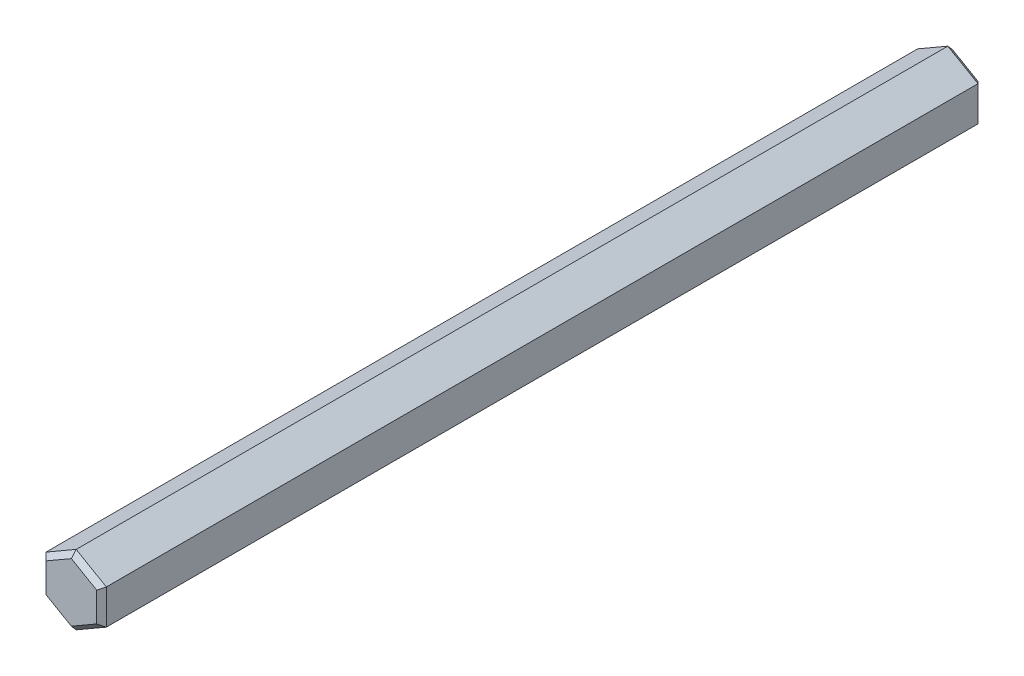
ISO-10303-21;
HEADER;
FILE_DESCRIPTION(('STEP AP214'),'2;1');
FILE_NAME('part.step','',(''),(''),'','','');
FILE_SCHEMA(('AUTOMOTIVE_DESIGN { 1 0 10303 214 1 1 1 1 }'));
ENDSEC;
DATA;
#1=APPLICATION_CONTEXT('core data for automotive mechanical design processes');
#2=APPLICATION_PROTOCOL_DEFINITION('international standard','automotive_design',2000,#1);
#3=PRODUCT_CONTEXT('',#1,'mechanical');
#4=PRODUCT('Part','Part','',(#3));
#5=PRODUCT_RELATED_PRODUCT_CATEGORY('part','',(#4));
#6=PRODUCT_DEFINITION_FORMATION('','',#4);
#7=PRODUCT_DEFINITION_CONTEXT('part definition',#1,'design');
#8=PRODUCT_DEFINITION('design','',#6,#7);
#9=PRODUCT_DEFINITION_SHAPE('','',#8);
#10=(LENGTH_UNIT() NAMED_UNIT(*) SI_UNIT(.MILLI.,.METRE.));
#11=(NAMED_UNIT(*) PLANE_ANGLE_UNIT() SI_UNIT($,.RADIAN.));
#12=(NAMED_UNIT(*) SI_UNIT($,.STERADIAN.) SOLID_ANGLE_UNIT());
#13=UNCERTAINTY_MEASURE_WITH_UNIT(LENGTH_MEASURE(1.E-05),#10,'distance_accuracy_value','');
#14=(GEOMETRIC_REPRESENTATION_CONTEXT(3) GLOBAL_UNCERTAINTY_ASSIGNED_CONTEXT((#13)) GLOBAL_UNIT_ASSIGNED_CONTEXT((#10,
#11,#12)) REPRESENTATION_CONTEXT('',''));
#15=CARTESIAN_POINT('',(0.,0.,0.));
#16=DIRECTION('',(0.,0.,1.));
#17=DIRECTION('',(1.,0.,0.));
#18=AXIS2_PLACEMENT_3D('',#15,#16,#17);
#19=CARTESIAN_POINT('',(-2.5,-1.44337567297406,1.975));
#20=DIRECTION('',(-0.5,-0.866025403784439,0.));
#21=DIRECTION('',(0.866025403784439,-0.5,0.));
#22=AXIS2_PLACEMENT_3D('',#19,#20,#21);
#23=PLANE('',#22);
#24=DIRECTION('',(0.,0.,1.));
#25=VECTOR('',#24,1.);
#26=CARTESIAN_POINT('',(-2.5,-1.44337567297406,1.975));
#27=LINE('',#26,#25);
#28=CARTESIAN_POINT('',(-2.5,-1.44337567297406,2.37500000000001));
#29=VERTEX_POINT('',#28);
#30=CARTESIAN_POINT('',(-2.5,-1.44337567297406,74.6));
#31=VERTEX_POINT('',#30);
#32=EDGE_CURVE('E150',#29,#31,#27,.T.);
#33=ORIENTED_EDGE('',*,*,#32,.F.);
#34=DIRECTION('',(0.866025403784439,-0.5,0.));
#35=VECTOR('',#34,1.);
#36=CARTESIAN_POINT('',(0.,-2.88675134594813,2.37500000000001));
#37=LINE('',#36,#35);
#38=CARTESIAN_POINT('',(0.,-2.88675134594813,2.37500000000001));
#39=VERTEX_POINT('',#38);
#40=EDGE_CURVE('E182',#29,#39,#37,.T.);
#41=ORIENTED_EDGE('',*,*,#40,.T.);
#42=DIRECTION('',(0.,0.,1.));
#43=VECTOR('',#42,1.);
#44=CARTESIAN_POINT('',(0.,-2.88675134594813,1.975));
#45=LINE('',#44,#43);
#46=CARTESIAN_POINT('',(0.,-2.88675134594813,74.6));
#47=VERTEX_POINT('',#46);
#48=EDGE_CURVE('E215',#39,#47,#45,.T.);
#49=ORIENTED_EDGE('',*,*,#48,.T.);
#50=DIRECTION('',(-0.866025403784439,0.5,0.));
#51=VECTOR('',#50,1.);
#52=CARTESIAN_POINT('',(-2.5,-1.44337567297406,74.6));
#53=LINE('',#52,#51);
#54=EDGE_CURVE('E180',#47,#31,#53,.T.);
#55=ORIENTED_EDGE('',*,*,#54,.T.);
#56=EDGE_LOOP('',(#33,#41,#49,#55));
#57=FACE_BOUND('',#56,.T.);
#58=ADVANCED_FACE('F33',(#57),#23,.T.);
#59=CARTESIAN_POINT('',(-2.5,1.44337567297407,1.975));
#60=DIRECTION('',(-1.,0.,0.));
#61=DIRECTION('',(0.,0.,1.));
#62=AXIS2_PLACEMENT_3D('',#59,#60,#61);
#63=PLANE('',#62);
#64=DIRECTION('',(0.,0.,1.));
#65=VECTOR('',#64,1.);
#66=CARTESIAN_POINT('',(-2.5,1.44337567297407,1.975));
#67=LINE('',#66,#65);
#68=CARTESIAN_POINT('',(-2.5,1.44337567297407,2.37500000000001));
#69=VERTEX_POINT('',#68);
#70=CARTESIAN_POINT('',(-2.5,1.44337567297407,74.6));
#71=VERTEX_POINT('',#70);
#72=EDGE_CURVE('E131',#69,#71,#67,.T.);
#73=ORIENTED_EDGE('',*,*,#72,.F.);
#74=DIRECTION('',(0.,-1.,0.));
#75=VECTOR('',#74,1.);
#76=CARTESIAN_POINT('',(-2.5,-1.44337567297406,2.37500000000001));
#77=LINE('',#76,#75);
#78=EDGE_CURVE('E146',#69,#29,#77,.T.);
#79=ORIENTED_EDGE('',*,*,#78,.T.);
#80=ORIENTED_EDGE('',*,*,#32,.T.);
#81=DIRECTION('',(0.,1.,0.));
#82=VECTOR('',#81,1.);
#83=CARTESIAN_POINT('',(-2.5,1.44337567297407,74.6));
#84=LINE('',#83,#82);
#85=EDGE_CURVE('E149',#31,#71,#84,.T.);
#86=ORIENTED_EDGE('',*,*,#85,.T.);
#87=EDGE_LOOP('',(#73,#79,#80,#86));
#88=FACE_BOUND('',#87,.T.);
#89=ADVANCED_FACE('F143',(#88),#63,.T.);
#90=CARTESIAN_POINT('',(0.,2.88675134594813,1.975));
#91=DIRECTION('',(-0.5,0.866025403784439,0.));
#92=DIRECTION('',(-0.866025403784439,-0.5,0.));
#93=AXIS2_PLACEMENT_3D('',#90,#91,#92);
#94=PLANE('',#93);
#95=DIRECTION('',(0.,0.,1.));
#96=VECTOR('',#95,1.);
#97=CARTESIAN_POINT('',(0.,2.88675134594813,1.975));
#98=LINE('',#97,#96);
#99=CARTESIAN_POINT('',(0.,2.88675134594813,2.37500000000001));
#100=VERTEX_POINT('',#99);
#101=CARTESIAN_POINT('',(0.,2.88675134594813,74.6));
#102=VERTEX_POINT('',#101);
#103=EDGE_CURVE('E133',#100,#102,#98,.T.);
#104=ORIENTED_EDGE('',*,*,#103,.F.);
#105=DIRECTION('',(-0.866025403784439,-0.5,0.));
#106=VECTOR('',#105,1.);
#107=CARTESIAN_POINT('',(-2.5,1.44337567297407,2.37500000000001));
#108=LINE('',#107,#106);
#109=EDGE_CURVE('E127',#100,#69,#108,.T.);
#110=ORIENTED_EDGE('',*,*,#109,.T.);
#111=ORIENTED_EDGE('',*,*,#72,.T.);
#112=DIRECTION('',(0.866025403784439,0.5,0.));
#113=VECTOR('',#112,1.);
#114=CARTESIAN_POINT('',(0.,2.88675134594813,74.6));
#115=LINE('',#114,#113);
#116=EDGE_CURVE('E139',#71,#102,#115,.T.);
#117=ORIENTED_EDGE('',*,*,#116,.T.);
#118=EDGE_LOOP('',(#104,#110,#111,#117));
#119=FACE_BOUND('',#118,.T.);
#120=ADVANCED_FACE('F129',(#119),#94,.T.);
#121=CARTESIAN_POINT('',(2.5,1.44337567297406,1.975));
#122=DIRECTION('',(0.5,0.866025403784439,0.));
#123=DIRECTION('',(-0.866025403784439,0.5,0.));
#124=AXIS2_PLACEMENT_3D('',#121,#122,#123);
#125=PLANE('',#124);
#126=DIRECTION('',(0.,0.,1.));
#127=VECTOR('',#126,1.);
#128=CARTESIAN_POINT('',(2.5,1.44337567297406,1.975));
#129=LINE('',#128,#127);
#130=CARTESIAN_POINT('',(2.5,1.44337567297406,2.37500000000001));
#131=VERTEX_POINT('',#130);
#132=CARTESIAN_POINT('',(2.5,1.44337567297406,74.6));
#133=VERTEX_POINT('',#132);
#134=EDGE_CURVE('E249',#131,#133,#129,.T.);
#135=ORIENTED_EDGE('',*,*,#134,.F.);
#136=DIRECTION('',(-0.866025403784439,0.5,0.));
#137=VECTOR('',#136,1.);
#138=CARTESIAN_POINT('',(0.,2.88675134594813,2.37500000000001));
#139=LINE('',#138,#137);
#140=EDGE_CURVE('E190',#131,#100,#139,.T.);
#141=ORIENTED_EDGE('',*,*,#140,.T.);
#142=ORIENTED_EDGE('',*,*,#103,.T.);
#143=DIRECTION('',(0.866025403784439,-0.5,0.));
#144=VECTOR('',#143,1.);
#145=CARTESIAN_POINT('',(2.5,1.44337567297406,74.6));
#146=LINE('',#145,#144);
#147=EDGE_CURVE('E188',#102,#133,#146,.T.);
#148=ORIENTED_EDGE('',*,*,#147,.T.);
#149=EDGE_LOOP('',(#135,#141,#142,#148));
#150=FACE_BOUND('',#149,.T.);
#151=ADVANCED_FACE('F266',(#150),#125,.T.);
#152=CARTESIAN_POINT('',(2.5,-1.44337567297406,1.975));
#153=DIRECTION('',(1.,0.,0.));
#154=DIRECTION('',(0.,0.,-1.));
#155=AXIS2_PLACEMENT_3D('',#152,#153,#154);
#156=PLANE('',#155);
#157=DIRECTION('',(0.,0.,1.));
#158=VECTOR('',#157,1.);
#159=CARTESIAN_POINT('',(2.5,-1.44337567297406,1.975));
#160=LINE('',#159,#158);
#161=CARTESIAN_POINT('',(2.5,-1.44337567297406,2.37500000000001));
#162=VERTEX_POINT('',#161);
#163=CARTESIAN_POINT('',(2.5,-1.44337567297406,74.6));
#164=VERTEX_POINT('',#163);
#165=EDGE_CURVE('E247',#162,#164,#160,.T.);
#166=ORIENTED_EDGE('',*,*,#165,.F.);
#167=DIRECTION('',(0.,1.,0.));
#168=VECTOR('',#167,1.);
#169=CARTESIAN_POINT('',(2.5,1.44337567297406,2.37500000000001));
#170=LINE('',#169,#168);
#171=EDGE_CURVE('E194',#162,#131,#170,.T.);
#172=ORIENTED_EDGE('',*,*,#171,.T.);
#173=ORIENTED_EDGE('',*,*,#134,.T.);
#174=DIRECTION('',(0.,-1.,0.));
#175=VECTOR('',#174,1.);
#176=CARTESIAN_POINT('',(2.5,-1.44337567297406,74.6));
#177=LINE('',#176,#175);
#178=EDGE_CURVE('E192',#133,#164,#177,.T.);
#179=ORIENTED_EDGE('',*,*,#178,.T.);
#180=EDGE_LOOP('',(#166,#172,#173,#179));
#181=FACE_BOUND('',#180,.T.);
#182=ADVANCED_FACE('F303',(#181),#156,.T.);
#183=CARTESIAN_POINT('',(0.,-2.88675134594813,1.975));
#184=DIRECTION('',(0.5,-0.866025403784439,0.));
#185=DIRECTION('',(0.866025403784439,0.5,0.));
#186=AXIS2_PLACEMENT_3D('',#183,#184,#185);
#187=PLANE('',#186);
#188=ORIENTED_EDGE('',*,*,#48,.F.);
#189=DIRECTION('',(0.866025403784439,0.5,0.));
#190=VECTOR('',#189,1.);
#191=CARTESIAN_POINT('',(2.5,-1.44337567297406,2.37500000000001));
#192=LINE('',#191,#190);
#193=EDGE_CURVE('E186',#39,#162,#192,.T.);
#194=ORIENTED_EDGE('',*,*,#193,.T.);
#195=ORIENTED_EDGE('',*,*,#165,.T.);
#196=DIRECTION('',(-0.866025403784439,-0.5,0.));
#197=VECTOR('',#196,1.);
#198=CARTESIAN_POINT('',(0.,-2.88675134594813,74.6));
#199=LINE('',#198,#197);
#200=EDGE_CURVE('E138',#164,#47,#199,.T.);
#201=ORIENTED_EDGE('',*,*,#200,.T.);
#202=EDGE_LOOP('',(#188,#194,#195,#201));
#203=FACE_BOUND('',#202,.T.);
#204=ADVANCED_FACE('F244',(#203),#187,.T.);
#205=CARTESIAN_POINT('',(0.,0.,1.975));
#206=DIRECTION('',(0.,0.,1.));
#207=DIRECTION('',(1.,0.,0.));
#208=AXIS2_PLACEMENT_3D('',#205,#206,#207);
#209=PLANE('',#208);
#210=DIRECTION('',(-0.866025403784439,0.5,0.));
#211=VECTOR('',#210,1.);
#212=CARTESIAN_POINT('',(-2.3,-1.09696551146029,1.975));
#213=LINE('',#212,#211);
#214=CARTESIAN_POINT('',(0.,-2.42487113059643,1.975));
#215=VERTEX_POINT('',#214);
#216=CARTESIAN_POINT('',(-2.1,-1.21243556529822,1.975));
#217=VERTEX_POINT('',#216);
#218=EDGE_CURVE('E176',#215,#217,#213,.T.);
#219=ORIENTED_EDGE('',*,*,#218,.T.);
#220=DIRECTION('',(0.,1.,0.));
#221=VECTOR('',#220,1.);
#222=CARTESIAN_POINT('',(-2.1,1.44337567297407,1.975));
#223=LINE('',#222,#221);
#224=CARTESIAN_POINT('',(-2.1,1.21243556529822,1.975));
#225=VERTEX_POINT('',#224);
#226=EDGE_CURVE('E178',#217,#225,#223,.T.);
#227=ORIENTED_EDGE('',*,*,#226,.T.);
#228=DIRECTION('',(0.866025403784439,0.5,0.));
#229=VECTOR('',#228,1.);
#230=CARTESIAN_POINT('',(0.199999999999997,2.54034118443435,1.975));
#231=LINE('',#230,#229);
#232=CARTESIAN_POINT('',(0.,2.42487113059643,1.975));
#233=VERTEX_POINT('',#232);
#234=EDGE_CURVE('E155',#225,#233,#231,.T.);
#235=ORIENTED_EDGE('',*,*,#234,.T.);
#236=DIRECTION('',(0.866025403784439,-0.5,0.));
#237=VECTOR('',#236,1.);
#238=CARTESIAN_POINT('',(2.3,1.09696551146029,1.975));
#239=LINE('',#238,#237);
#240=CARTESIAN_POINT('',(2.1,1.21243556529821,1.975));
#241=VERTEX_POINT('',#240);
#242=EDGE_CURVE('E167',#233,#241,#239,.T.);
#243=ORIENTED_EDGE('',*,*,#242,.T.);
#244=DIRECTION('',(0.,-1.,0.));
#245=VECTOR('',#244,1.);
#246=CARTESIAN_POINT('',(2.1,-1.44337567297406,1.975));
#247=LINE('',#246,#245);
#248=CARTESIAN_POINT('',(2.1,-1.21243556529821,1.975));
#249=VERTEX_POINT('',#248);
#250=EDGE_CURVE('E165',#241,#249,#247,.T.);
#251=ORIENTED_EDGE('',*,*,#250,.T.);
#252=DIRECTION('',(-0.866025403784439,-0.5,0.));
#253=VECTOR('',#252,1.);
#254=CARTESIAN_POINT('',(-0.199999999999999,-2.54034118443435,1.975));
#255=LINE('',#254,#253);
#256=EDGE_CURVE('E173',#249,#215,#255,.T.);
#257=ORIENTED_EDGE('',*,*,#256,.T.);
#258=EDGE_LOOP('',(#219,#227,#235,#243,#251,#257));
#259=FACE_BOUND('',#258,.T.);
#260=ADVANCED_FACE('F274',(#259),#209,.F.);
#261=CARTESIAN_POINT('',(0.,0.,75.));
#262=DIRECTION('',(0.,0.,1.));
#263=DIRECTION('',(1.,0.,0.));
#264=AXIS2_PLACEMENT_3D('',#261,#262,#263);
#265=PLANE('',#264);
#266=DIRECTION('',(-0.866025403784439,0.5,0.));
#267=VECTOR('',#266,1.);
#268=CARTESIAN_POINT('',(1.05,1.81865334794732,75.));
#269=LINE('',#268,#267);
#270=CARTESIAN_POINT('',(2.09999999999999,1.21243556529821,75.));
#271=VERTEX_POINT('',#270);
#272=CARTESIAN_POINT('',(0.,2.42487113059642,75.));
#273=VERTEX_POINT('',#272);
#274=EDGE_CURVE('E57',#271,#273,#269,.T.);
#275=ORIENTED_EDGE('',*,*,#274,.T.);
#276=DIRECTION('',(-0.866025403784439,-0.5,0.));
#277=VECTOR('',#276,1.);
#278=CARTESIAN_POINT('',(-1.05,1.81865334794732,75.));
#279=LINE('',#278,#277);
#280=CARTESIAN_POINT('',(-2.1,1.21243556529821,75.));
#281=VERTEX_POINT('',#280);
#282=EDGE_CURVE('E11',#273,#281,#279,.T.);
#283=ORIENTED_EDGE('',*,*,#282,.T.);
#284=DIRECTION('',(0.,-1.,0.));
#285=VECTOR('',#284,1.);
#286=CARTESIAN_POINT('',(-2.1,0.,75.));
#287=LINE('',#286,#285);
#288=CARTESIAN_POINT('',(-2.1,-1.21243556529821,75.));
#289=VERTEX_POINT('',#288);
#290=EDGE_CURVE('E42',#281,#289,#287,.T.);
#291=ORIENTED_EDGE('',*,*,#290,.T.);
#292=DIRECTION('',(0.866025403784439,-0.5,0.));
#293=VECTOR('',#292,1.);
#294=CARTESIAN_POINT('',(-1.05,-1.81865334794732,75.));
#295=LINE('',#294,#293);
#296=CARTESIAN_POINT('',(0.,-2.42487113059642,75.));
#297=VERTEX_POINT('',#296);
#298=EDGE_CURVE('E200',#289,#297,#295,.T.);
#299=ORIENTED_EDGE('',*,*,#298,.T.);
#300=DIRECTION('',(0.866025403784439,0.5,0.));
#301=VECTOR('',#300,1.);
#302=CARTESIAN_POINT('',(1.05,-1.81865334794732,75.));
#303=LINE('',#302,#301);
#304=CARTESIAN_POINT('',(2.09999999999999,-1.21243556529821,75.));
#305=VERTEX_POINT('',#304);
#306=EDGE_CURVE('E196',#297,#305,#303,.T.);
#307=ORIENTED_EDGE('',*,*,#306,.T.);
#308=DIRECTION('',(0.,1.,0.));
#309=VECTOR('',#308,1.);
#310=CARTESIAN_POINT('',(2.09999999999999,0.,75.));
#311=LINE('',#310,#309);
#312=EDGE_CURVE('E198',#305,#271,#311,.T.);
#313=ORIENTED_EDGE('',*,*,#312,.T.);
#314=EDGE_LOOP('',(#275,#283,#291,#299,#307,#313));
#315=FACE_BOUND('',#314,.T.);
#316=ADVANCED_FACE('F259',(#315),#265,.T.);
#317=CARTESIAN_POINT('',(2.5,-1.44337567297406,2.37500000000001));
#318=DIRECTION('',(0.707106781186554,0.,-0.707106781186541));
#319=DIRECTION('',(0.,-1.,0.));
#320=AXIS2_PLACEMENT_3D('',#317,#318,#319);
#321=PLANE('',#320);
#322=DIRECTION('',(-0.654653670707972,0.377964473009224,-0.654653670707984));
#323=VECTOR('',#322,1.);
#324=CARTESIAN_POINT('',(2.5,-1.44337567297406,2.37500000000001));
#325=LINE('',#324,#323);
#326=EDGE_CURVE('E209',#249,#162,#325,.F.);
#327=ORIENTED_EDGE('',*,*,#326,.F.);
#328=ORIENTED_EDGE('',*,*,#250,.F.);
#329=DIRECTION('',(0.654653670707972,0.377964473009225,0.654653670707984));
#330=VECTOR('',#329,1.);
#331=CARTESIAN_POINT('',(1.7857142857143,1.03098262355291,1.66071428571429));
#332=LINE('',#331,#330);
#333=EDGE_CURVE('E212',#131,#241,#332,.F.);
#334=ORIENTED_EDGE('',*,*,#333,.F.);
#335=ORIENTED_EDGE('',*,*,#171,.F.);
#336=EDGE_LOOP('',(#327,#328,#334,#335));
#337=FACE_BOUND('',#336,.T.);
#338=ADVANCED_FACE('F277',(#337),#321,.T.);
#339=CARTESIAN_POINT('',(2.5,1.44337567297406,2.37500000000001));
#340=DIRECTION('',(0.353553390593277,0.6123724356958,-0.707106781186541));
#341=DIRECTION('',(0.866025403784439,-0.5,0.));
#342=AXIS2_PLACEMENT_3D('',#339,#340,#341);
#343=PLANE('',#342);
#344=ORIENTED_EDGE('',*,*,#333,.T.);
#345=ORIENTED_EDGE('',*,*,#242,.F.);
#346=DIRECTION('',(0.,0.755928946018449,0.654653670707984));
#347=VECTOR('',#346,1.);
#348=CARTESIAN_POINT('',(0.,2.06196524710582,1.66071428571429));
#349=LINE('',#348,#347);
#350=EDGE_CURVE('E207',#100,#233,#349,.F.);
#351=ORIENTED_EDGE('',*,*,#350,.F.);
#352=ORIENTED_EDGE('',*,*,#140,.F.);
#353=EDGE_LOOP('',(#344,#345,#351,#352));
#354=FACE_BOUND('',#353,.T.);
#355=ADVANCED_FACE('F270',(#354),#343,.T.);
#356=CARTESIAN_POINT('',(0.,-2.88675134594813,2.37500000000001));
#357=DIRECTION('',(0.353553390593277,-0.6123724356958,-0.707106781186541));
#358=DIRECTION('',(-0.866025403784439,-0.5,0.));
#359=AXIS2_PLACEMENT_3D('',#356,#357,#358);
#360=PLANE('',#359);
#361=ORIENTED_EDGE('',*,*,#326,.T.);
#362=ORIENTED_EDGE('',*,*,#193,.F.);
#363=DIRECTION('',(0.,0.755928946018449,-0.654653670707984));
#364=VECTOR('',#363,1.);
#365=CARTESIAN_POINT('',(0.,-2.88675134594813,2.37500000000001));
#366=LINE('',#365,#364);
#367=EDGE_CURVE('E159',#215,#39,#366,.F.);
#368=ORIENTED_EDGE('',*,*,#367,.F.);
#369=ORIENTED_EDGE('',*,*,#256,.F.);
#370=EDGE_LOOP('',(#361,#362,#368,#369));
#371=FACE_BOUND('',#370,.T.);
#372=ADVANCED_FACE('F282',(#371),#360,.T.);
#373=CARTESIAN_POINT('',(0.,2.88675134594813,2.37500000000001));
#374=DIRECTION('',(-0.353553390593277,0.6123724356958,-0.707106781186541));
#375=DIRECTION('',(0.866025403784439,0.5,0.));
#376=AXIS2_PLACEMENT_3D('',#373,#374,#375);
#377=PLANE('',#376);
#378=ORIENTED_EDGE('',*,*,#350,.T.);
#379=ORIENTED_EDGE('',*,*,#234,.F.);
#380=DIRECTION('',(-0.654653670707972,0.377964473009224,0.654653670707984));
#381=VECTOR('',#380,1.);
#382=CARTESIAN_POINT('',(-1.7857142857143,1.03098262355291,1.66071428571429));
#383=LINE('',#382,#381);
#384=EDGE_CURVE('E153',#69,#225,#383,.F.);
#385=ORIENTED_EDGE('',*,*,#384,.F.);
#386=ORIENTED_EDGE('',*,*,#109,.F.);
#387=EDGE_LOOP('',(#378,#379,#385,#386));
#388=FACE_BOUND('',#387,.T.);
#389=ADVANCED_FACE('F154',(#388),#377,.T.);
#390=CARTESIAN_POINT('',(-2.5,-1.44337567297406,2.37500000000001));
#391=DIRECTION('',(-0.353553390593277,-0.6123724356958,-0.707106781186541));
#392=DIRECTION('',(-0.866025403784439,0.5,0.));
#393=AXIS2_PLACEMENT_3D('',#390,#391,#392);
#394=PLANE('',#393);
#395=ORIENTED_EDGE('',*,*,#367,.T.);
#396=ORIENTED_EDGE('',*,*,#40,.F.);
#397=DIRECTION('',(0.654653670707972,0.377964473009225,-0.654653670707984));
#398=VECTOR('',#397,1.);
#399=CARTESIAN_POINT('',(-2.5,-1.44337567297406,2.37500000000001));
#400=LINE('',#399,#398);
#401=EDGE_CURVE('E160',#217,#29,#400,.F.);
#402=ORIENTED_EDGE('',*,*,#401,.F.);
#403=ORIENTED_EDGE('',*,*,#218,.F.);
#404=EDGE_LOOP('',(#395,#396,#402,#403));
#405=FACE_BOUND('',#404,.T.);
#406=ADVANCED_FACE('F285',(#405),#394,.T.);
#407=CARTESIAN_POINT('',(-2.5,1.44337567297407,2.37500000000001));
#408=DIRECTION('',(-0.707106781186554,0.,-0.707106781186541));
#409=DIRECTION('',(0.,1.,0.));
#410=AXIS2_PLACEMENT_3D('',#407,#408,#409);
#411=PLANE('',#410);
#412=ORIENTED_EDGE('',*,*,#384,.T.);
#413=ORIENTED_EDGE('',*,*,#226,.F.);
#414=ORIENTED_EDGE('',*,*,#401,.T.);
#415=ORIENTED_EDGE('',*,*,#78,.F.);
#416=EDGE_LOOP('',(#412,#413,#414,#415));
#417=FACE_BOUND('',#416,.T.);
#418=ADVANCED_FACE('F162',(#417),#411,.T.);
#419=CARTESIAN_POINT('',(1.05,-1.81865334794732,75.));
#420=DIRECTION('',(-0.353553390593277,0.6123724356958,-0.707106781186542));
#421=DIRECTION('',(0.866025403784439,0.5,0.));
#422=AXIS2_PLACEMENT_3D('',#419,#420,#421);
#423=PLANE('',#422);
#424=DIRECTION('',(0.,-0.755928946018449,-0.654653670707983));
#425=VECTOR('',#424,1.);
#426=CARTESIAN_POINT('',(0.,-2.07846096908265,75.3));
#427=LINE('',#426,#425);
#428=EDGE_CURVE('E224',#47,#297,#427,.F.);
#429=ORIENTED_EDGE('',*,*,#428,.F.);
#430=ORIENTED_EDGE('',*,*,#200,.F.);
#431=DIRECTION('',(-0.654653670707973,0.377964473009224,0.654653670707983));
#432=VECTOR('',#431,1.);
#433=CARTESIAN_POINT('',(1.8,-1.03923048454133,75.3));
#434=LINE('',#433,#432);
#435=EDGE_CURVE('E37',#305,#164,#434,.F.);
#436=ORIENTED_EDGE('',*,*,#435,.F.);
#437=ORIENTED_EDGE('',*,*,#306,.F.);
#438=EDGE_LOOP('',(#429,#430,#436,#437));
#439=FACE_BOUND('',#438,.T.);
#440=ADVANCED_FACE('F35',(#439),#423,.F.);
#441=CARTESIAN_POINT('',(2.09999999999999,0.,75.));
#442=DIRECTION('',(-0.707106781186553,0.,-0.707106781186542));
#443=DIRECTION('',(0.,1.,0.));
#444=AXIS2_PLACEMENT_3D('',#441,#442,#443);
#445=PLANE('',#444);
#446=ORIENTED_EDGE('',*,*,#435,.T.);
#447=ORIENTED_EDGE('',*,*,#178,.F.);
#448=DIRECTION('',(-0.654653670707972,-0.377964473009225,0.654653670707983));
#449=VECTOR('',#448,1.);
#450=CARTESIAN_POINT('',(1.8,1.03923048454132,75.3));
#451=LINE('',#450,#449);
#452=EDGE_CURVE('E222',#271,#133,#451,.F.);
#453=ORIENTED_EDGE('',*,*,#452,.F.);
#454=ORIENTED_EDGE('',*,*,#312,.F.);
#455=EDGE_LOOP('',(#446,#447,#453,#454));
#456=FACE_BOUND('',#455,.T.);
#457=ADVANCED_FACE('F235',(#456),#445,.F.);
#458=CARTESIAN_POINT('',(-1.05,-1.81865334794732,75.));
#459=DIRECTION('',(0.353553390593277,0.6123724356958,-0.707106781186541));
#460=DIRECTION('',(0.866025403784439,-0.5,0.));
#461=AXIS2_PLACEMENT_3D('',#458,#459,#460);
#462=PLANE('',#461);
#463=ORIENTED_EDGE('',*,*,#428,.T.);
#464=ORIENTED_EDGE('',*,*,#298,.F.);
#465=DIRECTION('',(-0.654653670707973,-0.377964473009224,-0.654653670707983));
#466=VECTOR('',#465,1.);
#467=CARTESIAN_POINT('',(-1.8,-1.03923048454133,75.3));
#468=LINE('',#467,#466);
#469=EDGE_CURVE('E219',#31,#289,#468,.F.);
#470=ORIENTED_EDGE('',*,*,#469,.F.);
#471=ORIENTED_EDGE('',*,*,#54,.F.);
#472=EDGE_LOOP('',(#463,#464,#470,#471));
#473=FACE_BOUND('',#472,.T.);
#474=ADVANCED_FACE('F256',(#473),#462,.F.);
#475=CARTESIAN_POINT('',(1.05,1.81865334794732,75.));
#476=DIRECTION('',(-0.353553390593276,-0.612372435695799,-0.707106781186542));
#477=DIRECTION('',(-0.866025403784439,0.5,0.));
#478=AXIS2_PLACEMENT_3D('',#475,#476,#477);
#479=PLANE('',#478);
#480=ORIENTED_EDGE('',*,*,#452,.T.);
#481=ORIENTED_EDGE('',*,*,#147,.F.);
#482=DIRECTION('',(0.,-0.755928946018449,0.654653670707983));
#483=VECTOR('',#482,1.);
#484=CARTESIAN_POINT('',(0.,2.07846096908265,75.3));
#485=LINE('',#484,#483);
#486=EDGE_CURVE('E217',#273,#102,#485,.F.);
#487=ORIENTED_EDGE('',*,*,#486,.F.);
#488=ORIENTED_EDGE('',*,*,#274,.F.);
#489=EDGE_LOOP('',(#480,#481,#487,#488));
#490=FACE_BOUND('',#489,.T.);
#491=ADVANCED_FACE('F263',(#490),#479,.F.);
#492=CARTESIAN_POINT('',(-2.1,0.,75.));
#493=DIRECTION('',(0.707106781186553,0.,-0.707106781186542));
#494=DIRECTION('',(0.,-1.,0.));
#495=AXIS2_PLACEMENT_3D('',#492,#493,#494);
#496=PLANE('',#495);
#497=ORIENTED_EDGE('',*,*,#469,.T.);
#498=ORIENTED_EDGE('',*,*,#290,.F.);
#499=DIRECTION('',(-0.654653670707972,0.377964473009225,-0.654653670707983));
#500=VECTOR('',#499,1.);
#501=CARTESIAN_POINT('',(-1.8,1.03923048454133,75.3));
#502=LINE('',#501,#500);
#503=EDGE_CURVE('E50',#71,#281,#502,.F.);
#504=ORIENTED_EDGE('',*,*,#503,.F.);
#505=ORIENTED_EDGE('',*,*,#85,.F.);
#506=EDGE_LOOP('',(#497,#498,#504,#505));
#507=FACE_BOUND('',#506,.T.);
#508=ADVANCED_FACE('F258',(#507),#496,.F.);
#509=CARTESIAN_POINT('',(-1.05,1.81865334794732,75.));
#510=DIRECTION('',(0.353553390593276,-0.612372435695799,-0.707106781186542));
#511=DIRECTION('',(-0.866025403784439,-0.5,0.));
#512=AXIS2_PLACEMENT_3D('',#509,#510,#511);
#513=PLANE('',#512);
#514=ORIENTED_EDGE('',*,*,#486,.T.);
#515=ORIENTED_EDGE('',*,*,#116,.F.);
#516=ORIENTED_EDGE('',*,*,#503,.T.);
#517=ORIENTED_EDGE('',*,*,#282,.F.);
#518=EDGE_LOOP('',(#514,#515,#516,#517));
#519=FACE_BOUND('',#518,.T.);
#520=ADVANCED_FACE('F260',(#519),#513,.F.);
#521=CLOSED_SHELL('',(#58,#89,#120,#151,#182,#204,#260,#316,#338,#355,#372,#389,#406,#418,#440,
#457,#474,#491,#508,#520));
#522=MANIFOLD_SOLID_BREP('B2',#521);
#523=ADVANCED_BREP_SHAPE_REPRESENTATION('',(#18,#522),#14);
#524=SHAPE_DEFINITION_REPRESENTATION(#9,#523);
ENDSEC;
END-ISO-10303-21;
